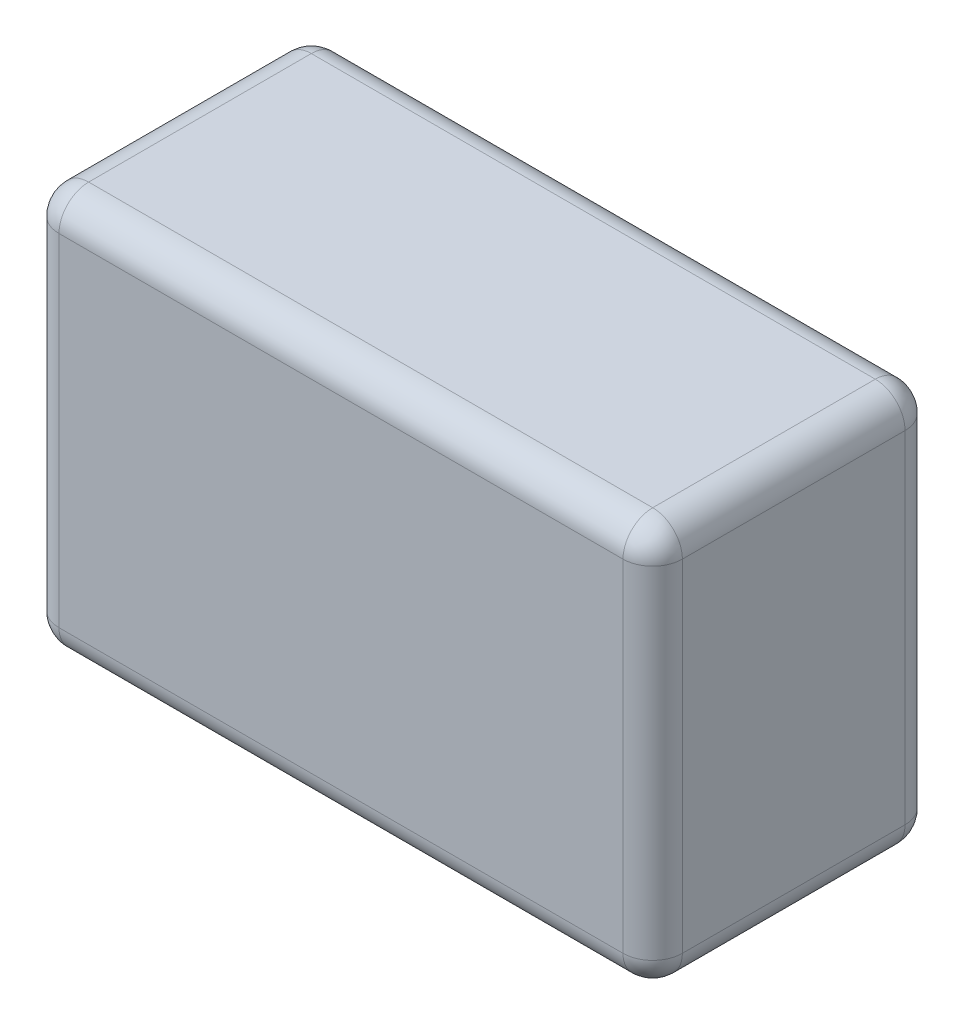
ISO-10303-21;
HEADER;
FILE_DESCRIPTION(('STEP AP214'),'2;1');
FILE_NAME('part.step','',(''),(''),'','','');
FILE_SCHEMA(('AUTOMOTIVE_DESIGN { 1 0 10303 214 1 1 1 1 }'));
ENDSEC;
DATA;
#1=APPLICATION_CONTEXT('core data for automotive mechanical design processes');
#2=APPLICATION_PROTOCOL_DEFINITION('international standard','automotive_design',2000,#1);
#3=PRODUCT_CONTEXT('',#1,'mechanical');
#4=PRODUCT('Part','Part','',(#3));
#5=PRODUCT_RELATED_PRODUCT_CATEGORY('part','',(#4));
#6=PRODUCT_DEFINITION_FORMATION('','',#4);
#7=PRODUCT_DEFINITION_CONTEXT('part definition',#1,'design');
#8=PRODUCT_DEFINITION('design','',#6,#7);
#9=PRODUCT_DEFINITION_SHAPE('','',#8);
#10=(LENGTH_UNIT() NAMED_UNIT(*) SI_UNIT(.MILLI.,.METRE.));
#11=(NAMED_UNIT(*) PLANE_ANGLE_UNIT() SI_UNIT($,.RADIAN.));
#12=(NAMED_UNIT(*) SI_UNIT($,.STERADIAN.) SOLID_ANGLE_UNIT());
#13=UNCERTAINTY_MEASURE_WITH_UNIT(LENGTH_MEASURE(1.E-05),#10,'distance_accuracy_value','');
#14=(GEOMETRIC_REPRESENTATION_CONTEXT(3) GLOBAL_UNCERTAINTY_ASSIGNED_CONTEXT((#13)) GLOBAL_UNIT_ASSIGNED_CONTEXT((#10,
#11,#12)) REPRESENTATION_CONTEXT('',''));
#15=CARTESIAN_POINT('',(0.,0.,0.));
#16=DIRECTION('',(0.,0.,1.));
#17=DIRECTION('',(1.,0.,0.));
#18=AXIS2_PLACEMENT_3D('',#15,#16,#17);
#19=CARTESIAN_POINT('',(0.95,0.575,0.85));
#20=DIRECTION('',(0.,0.,1.));
#21=DIRECTION('',(1.,0.,0.));
#22=AXIS2_PLACEMENT_3D('',#19,#20,#21);
#23=SPHERICAL_SURFACE('',#22,0.1);
#24=CARTESIAN_POINT('',(0.95,0.575,0.85));
#25=DIRECTION('',(-1.,0.,0.));
#26=DIRECTION('',(0.,0.,1.));
#27=AXIS2_PLACEMENT_3D('',#24,#25,#26);
#28=CIRCLE('',#27,0.1);
#29=CARTESIAN_POINT('',(0.95,0.575,0.95));
#30=VERTEX_POINT('',#29);
#31=CARTESIAN_POINT('',(0.95,0.675,0.85));
#32=VERTEX_POINT('',#31);
#33=EDGE_CURVE('E107',#30,#32,#28,.T.);
#34=ORIENTED_EDGE('',*,*,#33,.F.);
#35=CARTESIAN_POINT('',(0.95,0.575,0.85));
#36=DIRECTION('',(0.,-1.,0.));
#37=DIRECTION('',(0.,0.,-1.));
#38=AXIS2_PLACEMENT_3D('',#35,#36,#37);
#39=CIRCLE('',#38,0.1);
#40=CARTESIAN_POINT('',(1.05,0.575,0.85));
#41=VERTEX_POINT('',#40);
#42=EDGE_CURVE('E161',#41,#30,#39,.T.);
#43=ORIENTED_EDGE('',*,*,#42,.F.);
#44=CARTESIAN_POINT('',(0.95,0.575,0.85));
#45=DIRECTION('',(0.,0.,-1.));
#46=DIRECTION('',(-1.,0.,0.));
#47=AXIS2_PLACEMENT_3D('',#44,#45,#46);
#48=CIRCLE('',#47,0.1);
#49=EDGE_CURVE('E133',#32,#41,#48,.T.);
#50=ORIENTED_EDGE('',*,*,#49,.F.);
#51=EDGE_LOOP('',(#34,#43,#50));
#52=FACE_BOUND('',#51,.T.);
#53=ADVANCED_FACE('F16',(#52),#23,.T.);
#54=CARTESIAN_POINT('',(-0.95,0.575,0.85));
#55=DIRECTION('',(0.,0.,1.));
#56=DIRECTION('',(0.,1.,0.));
#57=AXIS2_PLACEMENT_3D('',#54,#55,#56);
#58=SPHERICAL_SURFACE('',#57,0.1);
#59=CARTESIAN_POINT('',(-0.95,0.575,0.85));
#60=DIRECTION('',(0.,-1.,0.));
#61=DIRECTION('',(0.,0.,-1.));
#62=AXIS2_PLACEMENT_3D('',#59,#60,#61);
#63=CIRCLE('',#62,0.1);
#64=CARTESIAN_POINT('',(-0.95,0.575,0.95));
#65=VERTEX_POINT('',#64);
#66=CARTESIAN_POINT('',(-1.05,0.575,0.85));
#67=VERTEX_POINT('',#66);
#68=EDGE_CURVE('E122',#65,#67,#63,.T.);
#69=ORIENTED_EDGE('',*,*,#68,.F.);
#70=CARTESIAN_POINT('',(-0.95,0.575,0.85));
#71=DIRECTION('',(1.,0.,0.));
#72=DIRECTION('',(0.,0.,-1.));
#73=AXIS2_PLACEMENT_3D('',#70,#71,#72);
#74=CIRCLE('',#73,0.1);
#75=CARTESIAN_POINT('',(-0.95,0.675,0.85));
#76=VERTEX_POINT('',#75);
#77=EDGE_CURVE('E104',#76,#65,#74,.T.);
#78=ORIENTED_EDGE('',*,*,#77,.F.);
#79=CARTESIAN_POINT('',(-0.95,0.575,0.85));
#80=DIRECTION('',(0.,0.,-1.));
#81=DIRECTION('',(-1.,0.,0.));
#82=AXIS2_PLACEMENT_3D('',#79,#80,#81);
#83=CIRCLE('',#82,0.1);
#84=EDGE_CURVE('E120',#67,#76,#83,.T.);
#85=ORIENTED_EDGE('',*,*,#84,.F.);
#86=EDGE_LOOP('',(#69,#78,#85));
#87=FACE_BOUND('',#86,.T.);
#88=ADVANCED_FACE('F119',(#87),#58,.T.);
#89=CARTESIAN_POINT('',(-0.95,0.575,0.85));
#90=DIRECTION('',(0.,0.,-1.));
#91=DIRECTION('',(-1.,0.,0.));
#92=AXIS2_PLACEMENT_3D('',#89,#90,#91);
#93=CYLINDRICAL_SURFACE('',#92,0.1);
#94=ORIENTED_EDGE('',*,*,#84,.T.);
#95=DIRECTION('',(0.,0.,1.));
#96=VECTOR('',#95,1.);
#97=CARTESIAN_POINT('',(-0.95,0.675,0.475000000759869));
#98=LINE('',#97,#96);
#99=CARTESIAN_POINT('',(-0.95,0.675,0.1));
#100=VERTEX_POINT('',#99);
#101=EDGE_CURVE('E128',#100,#76,#98,.T.);
#102=ORIENTED_EDGE('',*,*,#101,.F.);
#103=CARTESIAN_POINT('',(-0.95,0.575,0.1));
#104=DIRECTION('',(0.,0.,-1.));
#105=DIRECTION('',(-1.,0.,0.));
#106=AXIS2_PLACEMENT_3D('',#103,#104,#105);
#107=CIRCLE('',#106,0.1);
#108=CARTESIAN_POINT('',(-1.05,0.575,0.1));
#109=VERTEX_POINT('',#108);
#110=EDGE_CURVE('E138',#109,#100,#107,.T.);
#111=ORIENTED_EDGE('',*,*,#110,.F.);
#112=DIRECTION('',(0.,0.,-1.));
#113=VECTOR('',#112,1.);
#114=CARTESIAN_POINT('',(-1.05,0.575,0.475));
#115=LINE('',#114,#113);
#116=EDGE_CURVE('E131',#67,#109,#115,.T.);
#117=ORIENTED_EDGE('',*,*,#116,.F.);
#118=EDGE_LOOP('',(#94,#102,#111,#117));
#119=FACE_BOUND('',#118,.T.);
#120=ADVANCED_FACE('F127',(#119),#93,.T.);
#121=CARTESIAN_POINT('',(0.95,0.575,0.1));
#122=DIRECTION('',(0.,0.,1.));
#123=DIRECTION('',(1.,0.,0.));
#124=AXIS2_PLACEMENT_3D('',#121,#122,#123);
#125=CYLINDRICAL_SURFACE('',#124,0.1);
#126=ORIENTED_EDGE('',*,*,#49,.T.);
#127=DIRECTION('',(0.,0.,1.));
#128=VECTOR('',#127,1.);
#129=CARTESIAN_POINT('',(1.05,0.575,0.475));
#130=LINE('',#129,#128);
#131=CARTESIAN_POINT('',(1.05,0.575,0.1));
#132=VERTEX_POINT('',#131);
#133=EDGE_CURVE('E151',#132,#41,#130,.T.);
#134=ORIENTED_EDGE('',*,*,#133,.F.);
#135=CARTESIAN_POINT('',(0.95,0.575,0.1));
#136=DIRECTION('',(0.,0.,-1.));
#137=DIRECTION('',(-1.,0.,0.));
#138=AXIS2_PLACEMENT_3D('',#135,#136,#137);
#139=CIRCLE('',#138,0.1);
#140=CARTESIAN_POINT('',(0.95,0.675,0.1));
#141=VERTEX_POINT('',#140);
#142=EDGE_CURVE('E140',#141,#132,#139,.T.);
#143=ORIENTED_EDGE('',*,*,#142,.F.);
#144=DIRECTION('',(0.,0.,-1.));
#145=VECTOR('',#144,1.);
#146=CARTESIAN_POINT('',(0.95,0.675,0.474999999240131));
#147=LINE('',#146,#145);
#148=EDGE_CURVE('E137',#32,#141,#147,.T.);
#149=ORIENTED_EDGE('',*,*,#148,.F.);
#150=EDGE_LOOP('',(#126,#134,#143,#149));
#151=FACE_BOUND('',#150,.T.);
#152=ADVANCED_FACE('F313',(#151),#125,.T.);
#153=CARTESIAN_POINT('',(0.95,-0.575,0.85));
#154=DIRECTION('',(0.,1.,0.));
#155=DIRECTION('',(0.,0.,1.));
#156=AXIS2_PLACEMENT_3D('',#153,#154,#155);
#157=CYLINDRICAL_SURFACE('',#156,0.1);
#158=DIRECTION('',(0.,-1.,0.));
#159=VECTOR('',#158,1.);
#160=CARTESIAN_POINT('',(1.05,0.,0.85));
#161=LINE('',#160,#159);
#162=CARTESIAN_POINT('',(1.05,-0.575,0.85));
#163=VERTEX_POINT('',#162);
#164=EDGE_CURVE('E286',#41,#163,#161,.T.);
#165=ORIENTED_EDGE('',*,*,#164,.F.);
#166=ORIENTED_EDGE('',*,*,#42,.T.);
#167=DIRECTION('',(0.,1.,0.));
#168=VECTOR('',#167,1.);
#169=CARTESIAN_POINT('',(0.95,1.07209434472427E-10,0.95));
#170=LINE('',#169,#168);
#171=CARTESIAN_POINT('',(0.95,-0.575,0.95));
#172=VERTEX_POINT('',#171);
#173=EDGE_CURVE('E274',#172,#30,#170,.T.);
#174=ORIENTED_EDGE('',*,*,#173,.F.);
#175=CARTESIAN_POINT('',(0.95,-0.575,0.85));
#176=DIRECTION('',(0.,-1.,0.));
#177=DIRECTION('',(0.,0.,-1.));
#178=AXIS2_PLACEMENT_3D('',#175,#176,#177);
#179=CIRCLE('',#178,0.1);
#180=EDGE_CURVE('E276',#163,#172,#179,.T.);
#181=ORIENTED_EDGE('',*,*,#180,.F.);
#182=EDGE_LOOP('',(#165,#166,#174,#181));
#183=FACE_BOUND('',#182,.T.);
#184=ADVANCED_FACE('F316',(#183),#157,.T.);
#185=CARTESIAN_POINT('',(-0.95,-0.575,0.85));
#186=DIRECTION('',(0.,1.,0.));
#187=DIRECTION('',(0.,0.,1.));
#188=AXIS2_PLACEMENT_3D('',#185,#186,#187);
#189=CYLINDRICAL_SURFACE('',#188,0.1);
#190=DIRECTION('',(0.,-1.,0.));
#191=VECTOR('',#190,1.);
#192=CARTESIAN_POINT('',(-0.95,-7.09761025993738E-11,0.95));
#193=LINE('',#192,#191);
#194=CARTESIAN_POINT('',(-0.95,-0.575,0.95));
#195=VERTEX_POINT('',#194);
#196=EDGE_CURVE('E267',#65,#195,#193,.T.);
#197=ORIENTED_EDGE('',*,*,#196,.F.);
#198=ORIENTED_EDGE('',*,*,#68,.T.);
#199=DIRECTION('',(0.,1.,0.));
#200=VECTOR('',#199,1.);
#201=CARTESIAN_POINT('',(-1.05,0.,0.85));
#202=LINE('',#201,#200);
#203=CARTESIAN_POINT('',(-1.05,-0.575,0.85));
#204=VERTEX_POINT('',#203);
#205=EDGE_CURVE('E152',#204,#67,#202,.T.);
#206=ORIENTED_EDGE('',*,*,#205,.F.);
#207=CARTESIAN_POINT('',(-0.95,-0.575,0.85));
#208=DIRECTION('',(0.,-1.,0.));
#209=DIRECTION('',(0.,0.,-1.));
#210=AXIS2_PLACEMENT_3D('',#207,#208,#209);
#211=CIRCLE('',#210,0.1);
#212=EDGE_CURVE('E281',#195,#204,#211,.T.);
#213=ORIENTED_EDGE('',*,*,#212,.F.);
#214=EDGE_LOOP('',(#197,#198,#206,#213));
#215=FACE_BOUND('',#214,.T.);
#216=ADVANCED_FACE('F381',(#215),#189,.T.);
#217=CARTESIAN_POINT('',(-0.95,0.575,0.1));
#218=DIRECTION('',(0.,0.,-1.));
#219=DIRECTION('',(1.,0.,0.));
#220=AXIS2_PLACEMENT_3D('',#217,#218,#219);
#221=SPHERICAL_SURFACE('',#220,0.1);
#222=CARTESIAN_POINT('',(-0.95,0.575,0.1));
#223=DIRECTION('',(0.,-1.,0.));
#224=DIRECTION('',(0.,0.,-1.));
#225=AXIS2_PLACEMENT_3D('',#222,#223,#224);
#226=CIRCLE('',#225,0.1);
#227=CARTESIAN_POINT('',(-0.95,0.575,0.));
#228=VERTEX_POINT('',#227);
#229=EDGE_CURVE('E257',#109,#228,#226,.T.);
#230=ORIENTED_EDGE('',*,*,#229,.F.);
#231=ORIENTED_EDGE('',*,*,#110,.T.);
#232=CARTESIAN_POINT('',(-0.95,0.575,0.1));
#233=DIRECTION('',(1.,0.,0.));
#234=DIRECTION('',(0.,0.,-1.));
#235=AXIS2_PLACEMENT_3D('',#232,#233,#234);
#236=CIRCLE('',#235,0.1);
#237=EDGE_CURVE('E114',#228,#100,#236,.T.);
#238=ORIENTED_EDGE('',*,*,#237,.F.);
#239=EDGE_LOOP('',(#230,#231,#238));
#240=FACE_BOUND('',#239,.T.);
#241=ADVANCED_FACE('F416',(#240),#221,.T.);
#242=CARTESIAN_POINT('',(0.95,0.575,0.1));
#243=DIRECTION('',(0.,0.,-1.));
#244=DIRECTION('',(0.,-1.,0.));
#245=AXIS2_PLACEMENT_3D('',#242,#243,#244);
#246=SPHERICAL_SURFACE('',#245,0.1);
#247=CARTESIAN_POINT('',(0.95,0.575,0.1));
#248=DIRECTION('',(-1.,0.,0.));
#249=DIRECTION('',(0.,0.,1.));
#250=AXIS2_PLACEMENT_3D('',#247,#248,#249);
#251=CIRCLE('',#250,0.1);
#252=CARTESIAN_POINT('',(0.95,0.575,0.));
#253=VERTEX_POINT('',#252);
#254=EDGE_CURVE('E113',#141,#253,#251,.T.);
#255=ORIENTED_EDGE('',*,*,#254,.F.);
#256=ORIENTED_EDGE('',*,*,#142,.T.);
#257=CARTESIAN_POINT('',(0.95,0.575,0.1));
#258=DIRECTION('',(0.,-1.,0.));
#259=DIRECTION('',(0.,0.,-1.));
#260=AXIS2_PLACEMENT_3D('',#257,#258,#259);
#261=CIRCLE('',#260,0.1);
#262=EDGE_CURVE('E233',#253,#132,#261,.T.);
#263=ORIENTED_EDGE('',*,*,#262,.F.);
#264=EDGE_LOOP('',(#255,#256,#263));
#265=FACE_BOUND('',#264,.T.);
#266=ADVANCED_FACE('F421',(#265),#246,.T.);
#267=CARTESIAN_POINT('',(-1.05,-0.576,0.099));
#268=DIRECTION('',(-1.,0.,0.));
#269=DIRECTION('',(0.,0.,1.));
#270=AXIS2_PLACEMENT_3D('',#267,#268,#269);
#271=PLANE('',#270);
#272=ORIENTED_EDGE('',*,*,#205,.T.);
#273=ORIENTED_EDGE('',*,*,#116,.T.);
#274=DIRECTION('',(0.,1.,0.));
#275=VECTOR('',#274,1.);
#276=CARTESIAN_POINT('',(-1.05,0.,0.1));
#277=LINE('',#276,#275);
#278=CARTESIAN_POINT('',(-1.05,-0.575,0.1));
#279=VERTEX_POINT('',#278);
#280=EDGE_CURVE('E262',#279,#109,#277,.T.);
#281=ORIENTED_EDGE('',*,*,#280,.F.);
#282=DIRECTION('',(0.,0.,-1.));
#283=VECTOR('',#282,1.);
#284=CARTESIAN_POINT('',(-1.05,-0.575,0.475));
#285=LINE('',#284,#283);
#286=EDGE_CURVE('E232',#204,#279,#285,.T.);
#287=ORIENTED_EDGE('',*,*,#286,.F.);
#288=EDGE_LOOP('',(#272,#273,#281,#287));
#289=FACE_BOUND('',#288,.T.);
#290=ADVANCED_FACE('F419',(#289),#271,.T.);
#291=CARTESIAN_POINT('',(1.05,-0.576,0.851));
#292=DIRECTION('',(1.,0.,0.));
#293=DIRECTION('',(0.,0.,-1.));
#294=AXIS2_PLACEMENT_3D('',#291,#292,#293);
#295=PLANE('',#294);
#296=ORIENTED_EDGE('',*,*,#164,.T.);
#297=DIRECTION('',(0.,0.,1.));
#298=VECTOR('',#297,1.);
#299=CARTESIAN_POINT('',(1.05,-0.575,0.475));
#300=LINE('',#299,#298);
#301=CARTESIAN_POINT('',(1.05,-0.575,0.1));
#302=VERTEX_POINT('',#301);
#303=EDGE_CURVE('E226',#302,#163,#300,.T.);
#304=ORIENTED_EDGE('',*,*,#303,.F.);
#305=DIRECTION('',(0.,-1.,0.));
#306=VECTOR('',#305,1.);
#307=CARTESIAN_POINT('',(1.05,0.,0.1));
#308=LINE('',#307,#306);
#309=EDGE_CURVE('E238',#132,#302,#308,.T.);
#310=ORIENTED_EDGE('',*,*,#309,.F.);
#311=ORIENTED_EDGE('',*,*,#133,.T.);
#312=EDGE_LOOP('',(#296,#304,#310,#311));
#313=FACE_BOUND('',#312,.T.);
#314=ADVANCED_FACE('F308',(#313),#295,.T.);
#315=CARTESIAN_POINT('',(-0.95,-0.575,0.85));
#316=DIRECTION('',(0.,0.,1.));
#317=DIRECTION('',(-1.,0.,0.));
#318=AXIS2_PLACEMENT_3D('',#315,#316,#317);
#319=SPHERICAL_SURFACE('',#318,0.1);
#320=CARTESIAN_POINT('',(-0.95,-0.575,0.85));
#321=DIRECTION('',(0.,0.,-1.));
#322=DIRECTION('',(-1.,0.,0.));
#323=AXIS2_PLACEMENT_3D('',#320,#321,#322);
#324=CIRCLE('',#323,0.1);
#325=CARTESIAN_POINT('',(-0.95,-0.675,0.85));
#326=VERTEX_POINT('',#325);
#327=EDGE_CURVE('E229',#326,#204,#324,.T.);
#328=ORIENTED_EDGE('',*,*,#327,.F.);
#329=CARTESIAN_POINT('',(-0.95,-0.575,0.85));
#330=DIRECTION('',(1.,0.,0.));
#331=DIRECTION('',(0.,0.,-1.));
#332=AXIS2_PLACEMENT_3D('',#329,#330,#331);
#333=CIRCLE('',#332,0.1);
#334=EDGE_CURVE('E211',#195,#326,#333,.T.);
#335=ORIENTED_EDGE('',*,*,#334,.F.);
#336=ORIENTED_EDGE('',*,*,#212,.T.);
#337=EDGE_LOOP('',(#328,#335,#336));
#338=FACE_BOUND('',#337,.T.);
#339=ADVANCED_FACE('F377',(#338),#319,.T.);
#340=CARTESIAN_POINT('',(0.95,-0.575,0.85));
#341=DIRECTION('',(0.,0.,1.));
#342=DIRECTION('',(0.,-1.,0.));
#343=AXIS2_PLACEMENT_3D('',#340,#341,#342);
#344=SPHERICAL_SURFACE('',#343,0.1);
#345=CARTESIAN_POINT('',(0.95,-0.575000000000001,0.85));
#346=DIRECTION('',(-1.,0.,0.));
#347=DIRECTION('',(0.,0.,1.));
#348=AXIS2_PLACEMENT_3D('',#345,#346,#347);
#349=CIRCLE('',#348,0.0999999999999995);
#350=CARTESIAN_POINT('',(0.95,-0.675,0.85));
#351=VERTEX_POINT('',#350);
#352=EDGE_CURVE('E202',#351,#172,#349,.T.);
#353=ORIENTED_EDGE('',*,*,#352,.F.);
#354=CARTESIAN_POINT('',(0.95,-0.575,0.85));
#355=DIRECTION('',(0.,0.,-1.));
#356=DIRECTION('',(-1.,0.,0.));
#357=AXIS2_PLACEMENT_3D('',#354,#355,#356);
#358=CIRCLE('',#357,0.1);
#359=EDGE_CURVE('E216',#163,#351,#358,.T.);
#360=ORIENTED_EDGE('',*,*,#359,.F.);
#361=ORIENTED_EDGE('',*,*,#180,.T.);
#362=EDGE_LOOP('',(#353,#360,#361));
#363=FACE_BOUND('',#362,.T.);
#364=ADVANCED_FACE('F319',(#363),#344,.T.);
#365=CARTESIAN_POINT('',(0.61895293528914,0.575,0.85));
#366=DIRECTION('',(-1.,0.,0.));
#367=DIRECTION('',(0.,0.,1.));
#368=AXIS2_PLACEMENT_3D('',#365,#366,#367);
#369=CYLINDRICAL_SURFACE('',#368,0.1);
#370=DIRECTION('',(-1.,0.,0.));
#371=VECTOR('',#370,1.);
#372=CARTESIAN_POINT('',(1.25028752542139E-09,0.575,0.95));
#373=LINE('',#372,#371);
#374=EDGE_CURVE('E199',#30,#65,#373,.T.);
#375=ORIENTED_EDGE('',*,*,#374,.F.);
#376=ORIENTED_EDGE('',*,*,#33,.T.);
#377=DIRECTION('',(1.,0.,0.));
#378=VECTOR('',#377,1.);
#379=CARTESIAN_POINT('',(-1.67369915669846E-11,0.675,0.85));
#380=LINE('',#379,#378);
#381=EDGE_CURVE('E101',#76,#32,#380,.T.);
#382=ORIENTED_EDGE('',*,*,#381,.F.);
#383=ORIENTED_EDGE('',*,*,#77,.T.);
#384=EDGE_LOOP('',(#375,#376,#382,#383));
#385=FACE_BOUND('',#384,.T.);
#386=ADVANCED_FACE('F103',(#385),#369,.T.);
#387=CARTESIAN_POINT('',(-0.95,-0.575,0.1));
#388=DIRECTION('',(0.,1.,0.));
#389=DIRECTION('',(0.,0.,1.));
#390=AXIS2_PLACEMENT_3D('',#387,#388,#389);
#391=CYLINDRICAL_SURFACE('',#390,0.1);
#392=ORIENTED_EDGE('',*,*,#280,.T.);
#393=ORIENTED_EDGE('',*,*,#229,.T.);
#394=DIRECTION('',(0.,1.,0.));
#395=VECTOR('',#394,1.);
#396=CARTESIAN_POINT('',(-0.95,7.09555027580966E-11,0.));
#397=LINE('',#396,#395);
#398=CARTESIAN_POINT('',(-0.95,-0.575,0.));
#399=VERTEX_POINT('',#398);
#400=EDGE_CURVE('E196',#399,#228,#397,.T.);
#401=ORIENTED_EDGE('',*,*,#400,.F.);
#402=CARTESIAN_POINT('',(-0.95,-0.575,0.1));
#403=DIRECTION('',(0.,-1.,0.));
#404=DIRECTION('',(0.,0.,-1.));
#405=AXIS2_PLACEMENT_3D('',#402,#403,#404);
#406=CIRCLE('',#405,0.1);
#407=EDGE_CURVE('E208',#279,#399,#406,.T.);
#408=ORIENTED_EDGE('',*,*,#407,.F.);
#409=EDGE_LOOP('',(#392,#393,#401,#408));
#410=FACE_BOUND('',#409,.T.);
#411=ADVANCED_FACE('F417',(#410),#391,.T.);
#412=CARTESIAN_POINT('',(-0.613226081666086,0.675,0.851000099874663));
#413=DIRECTION('',(0.,1.,0.));
#414=DIRECTION('',(1.,0.,0.));
#415=AXIS2_PLACEMENT_3D('',#412,#413,#414);
#416=PLANE('',#415);
#417=ORIENTED_EDGE('',*,*,#101,.T.);
#418=ORIENTED_EDGE('',*,*,#381,.T.);
#419=ORIENTED_EDGE('',*,*,#148,.T.);
#420=DIRECTION('',(1.,0.,0.));
#421=VECTOR('',#420,1.);
#422=CARTESIAN_POINT('',(9.5624964489751E-08,0.675,0.1));
#423=LINE('',#422,#421);
#424=EDGE_CURVE('E136',#100,#141,#423,.T.);
#425=ORIENTED_EDGE('',*,*,#424,.F.);
#426=EDGE_LOOP('',(#417,#418,#419,#425));
#427=FACE_BOUND('',#426,.T.);
#428=ADVANCED_FACE('F135',(#427),#416,.T.);
#429=CARTESIAN_POINT('',(0.95,-0.575,0.1));
#430=DIRECTION('',(0.,1.,0.));
#431=DIRECTION('',(0.,0.,1.));
#432=AXIS2_PLACEMENT_3D('',#429,#430,#431);
#433=CYLINDRICAL_SURFACE('',#432,0.1);
#434=DIRECTION('',(0.,-1.,0.));
#435=VECTOR('',#434,1.);
#436=CARTESIAN_POINT('',(0.95,-7.03774603698359E-11,0.));
#437=LINE('',#436,#435);
#438=CARTESIAN_POINT('',(0.95,-0.575,0.));
#439=VERTEX_POINT('',#438);
#440=EDGE_CURVE('E195',#253,#439,#437,.T.);
#441=ORIENTED_EDGE('',*,*,#440,.F.);
#442=ORIENTED_EDGE('',*,*,#262,.T.);
#443=ORIENTED_EDGE('',*,*,#309,.T.);
#444=CARTESIAN_POINT('',(0.95,-0.575,0.1));
#445=DIRECTION('',(0.,-1.,0.));
#446=DIRECTION('',(0.,0.,-1.));
#447=AXIS2_PLACEMENT_3D('',#444,#445,#446);
#448=CIRCLE('',#447,0.1);
#449=EDGE_CURVE('E329',#439,#302,#448,.T.);
#450=ORIENTED_EDGE('',*,*,#449,.F.);
#451=EDGE_LOOP('',(#441,#442,#443,#450));
#452=FACE_BOUND('',#451,.T.);
#453=ADVANCED_FACE('F334',(#452),#433,.T.);
#454=CARTESIAN_POINT('',(-0.95,-0.575,0.1));
#455=DIRECTION('',(0.,0.,1.));
#456=DIRECTION('',(1.,0.,0.));
#457=AXIS2_PLACEMENT_3D('',#454,#455,#456);
#458=CYLINDRICAL_SURFACE('',#457,0.1);
#459=ORIENTED_EDGE('',*,*,#327,.T.);
#460=ORIENTED_EDGE('',*,*,#286,.T.);
#461=CARTESIAN_POINT('',(-0.950000000000073,-0.57500000000007,0.1));
#462=DIRECTION('',(0.,0.,-1.));
#463=DIRECTION('',(-1.,0.,0.));
#464=AXIS2_PLACEMENT_3D('',#461,#462,#463);
#465=CIRCLE('',#464,0.0999999999999286);
#466=CARTESIAN_POINT('',(-0.95,-0.675,0.1));
#467=VERTEX_POINT('',#466);
#468=EDGE_CURVE('E201',#467,#279,#465,.T.);
#469=ORIENTED_EDGE('',*,*,#468,.F.);
#470=DIRECTION('',(0.,0.,-1.));
#471=VECTOR('',#470,1.);
#472=CARTESIAN_POINT('',(-0.95,-0.675,0.474999999242992));
#473=LINE('',#472,#471);
#474=EDGE_CURVE('E338',#326,#467,#473,.T.);
#475=ORIENTED_EDGE('',*,*,#474,.F.);
#476=EDGE_LOOP('',(#459,#460,#469,#475));
#477=FACE_BOUND('',#476,.T.);
#478=ADVANCED_FACE('F371',(#477),#458,.T.);
#479=CARTESIAN_POINT('',(0.95,-0.575,0.85));
#480=DIRECTION('',(0.,0.,-1.));
#481=DIRECTION('',(-1.,0.,0.));
#482=AXIS2_PLACEMENT_3D('',#479,#480,#481);
#483=CYLINDRICAL_SURFACE('',#482,0.1);
#484=ORIENTED_EDGE('',*,*,#359,.T.);
#485=DIRECTION('',(0.,0.,1.));
#486=VECTOR('',#485,1.);
#487=CARTESIAN_POINT('',(0.95,-0.675,0.474999999271759));
#488=LINE('',#487,#486);
#489=CARTESIAN_POINT('',(0.95,-0.675,0.1));
#490=VERTEX_POINT('',#489);
#491=EDGE_CURVE('E191',#490,#351,#488,.T.);
#492=ORIENTED_EDGE('',*,*,#491,.F.);
#493=CARTESIAN_POINT('',(0.95,-0.575,0.1));
#494=DIRECTION('',(0.,0.,-1.));
#495=DIRECTION('',(-1.,0.,0.));
#496=AXIS2_PLACEMENT_3D('',#493,#494,#495);
#497=CIRCLE('',#496,0.1);
#498=EDGE_CURVE('E324',#302,#490,#497,.T.);
#499=ORIENTED_EDGE('',*,*,#498,.F.);
#500=ORIENTED_EDGE('',*,*,#303,.T.);
#501=EDGE_LOOP('',(#484,#492,#499,#500));
#502=FACE_BOUND('',#501,.T.);
#503=ADVANCED_FACE('F322',(#502),#483,.T.);
#504=CARTESIAN_POINT('',(-0.614766781174764,-0.576000081533452,0.95));
#505=DIRECTION('',(0.,0.,1.));
#506=DIRECTION('',(1.,0.,0.));
#507=AXIS2_PLACEMENT_3D('',#504,#505,#506);
#508=PLANE('',#507);
#509=ORIENTED_EDGE('',*,*,#374,.T.);
#510=ORIENTED_EDGE('',*,*,#196,.T.);
#511=DIRECTION('',(-1.,0.,0.));
#512=VECTOR('',#511,1.);
#513=CARTESIAN_POINT('',(-4.22967504120145E-09,-0.575,0.95));
#514=LINE('',#513,#512);
#515=EDGE_CURVE('E189',#172,#195,#514,.T.);
#516=ORIENTED_EDGE('',*,*,#515,.F.);
#517=ORIENTED_EDGE('',*,*,#173,.T.);
#518=EDGE_LOOP('',(#509,#510,#516,#517));
#519=FACE_BOUND('',#518,.T.);
#520=ADVANCED_FACE('F382',(#519),#508,.T.);
#521=CARTESIAN_POINT('',(-0.95,-0.575,0.1));
#522=DIRECTION('',(0.,0.,-1.));
#523=DIRECTION('',(0.,1.,0.));
#524=AXIS2_PLACEMENT_3D('',#521,#522,#523);
#525=SPHERICAL_SURFACE('',#524,0.1);
#526=ORIENTED_EDGE('',*,*,#468,.T.);
#527=ORIENTED_EDGE('',*,*,#407,.T.);
#528=CARTESIAN_POINT('',(-0.95,-0.575,0.1));
#529=DIRECTION('',(1.,0.,0.));
#530=DIRECTION('',(0.,0.,-1.));
#531=AXIS2_PLACEMENT_3D('',#528,#529,#530);
#532=CIRCLE('',#531,0.1);
#533=EDGE_CURVE('E186',#467,#399,#532,.T.);
#534=ORIENTED_EDGE('',*,*,#533,.F.);
#535=EDGE_LOOP('',(#526,#527,#534));
#536=FACE_BOUND('',#535,.T.);
#537=ADVANCED_FACE('F364',(#536),#525,.T.);
#538=CARTESIAN_POINT('',(-0.618949867122069,0.575,0.1));
#539=DIRECTION('',(1.,0.,0.));
#540=DIRECTION('',(0.,0.,-1.));
#541=AXIS2_PLACEMENT_3D('',#538,#539,#540);
#542=CYLINDRICAL_SURFACE('',#541,0.1);
#543=DIRECTION('',(1.,0.,0.));
#544=VECTOR('',#543,1.);
#545=CARTESIAN_POINT('',(-1.37040156783161E-09,0.575,0.));
#546=LINE('',#545,#544);
#547=EDGE_CURVE('E184',#228,#253,#546,.T.);
#548=ORIENTED_EDGE('',*,*,#547,.F.);
#549=ORIENTED_EDGE('',*,*,#237,.T.);
#550=ORIENTED_EDGE('',*,*,#424,.T.);
#551=ORIENTED_EDGE('',*,*,#254,.T.);
#552=EDGE_LOOP('',(#548,#549,#550,#551));
#553=FACE_BOUND('',#552,.T.);
#554=ADVANCED_FACE('F390',(#553),#542,.T.);
#555=CARTESIAN_POINT('',(0.95,-0.575,0.1));
#556=DIRECTION('',(0.,0.,-1.));
#557=DIRECTION('',(-1.,0.,0.));
#558=AXIS2_PLACEMENT_3D('',#555,#556,#557);
#559=SPHERICAL_SURFACE('',#558,0.1);
#560=CARTESIAN_POINT('',(0.95,-0.575,0.1));
#561=DIRECTION('',(-1.,0.,0.));
#562=DIRECTION('',(0.,0.,1.));
#563=AXIS2_PLACEMENT_3D('',#560,#561,#562);
#564=CIRCLE('',#563,0.1);
#565=EDGE_CURVE('E181',#439,#490,#564,.T.);
#566=ORIENTED_EDGE('',*,*,#565,.F.);
#567=ORIENTED_EDGE('',*,*,#449,.T.);
#568=ORIENTED_EDGE('',*,*,#498,.T.);
#569=EDGE_LOOP('',(#566,#567,#568));
#570=FACE_BOUND('',#569,.T.);
#571=ADVANCED_FACE('F337',(#570),#559,.T.);
#572=CARTESIAN_POINT('',(-0.618949866460983,-0.575,0.85));
#573=DIRECTION('',(1.,0.,0.));
#574=DIRECTION('',(0.,0.,-1.));
#575=AXIS2_PLACEMENT_3D('',#572,#573,#574);
#576=CYLINDRICAL_SURFACE('',#575,0.1);
#577=DIRECTION('',(-1.,0.,0.));
#578=VECTOR('',#577,1.);
#579=CARTESIAN_POINT('',(-4.51361685657389E-09,-0.675,0.85));
#580=LINE('',#579,#578);
#581=EDGE_CURVE('E177',#351,#326,#580,.T.);
#582=ORIENTED_EDGE('',*,*,#581,.F.);
#583=ORIENTED_EDGE('',*,*,#352,.T.);
#584=ORIENTED_EDGE('',*,*,#515,.T.);
#585=ORIENTED_EDGE('',*,*,#334,.T.);
#586=EDGE_LOOP('',(#582,#583,#584,#585));
#587=FACE_BOUND('',#586,.T.);
#588=ADVANCED_FACE('F379',(#587),#576,.T.);
#589=CARTESIAN_POINT('',(0.614766781070068,-0.576000081605948,0.));
#590=DIRECTION('',(0.,0.,-1.));
#591=DIRECTION('',(-1.,0.,0.));
#592=AXIS2_PLACEMENT_3D('',#589,#590,#591);
#593=PLANE('',#592);
#594=ORIENTED_EDGE('',*,*,#440,.T.);
#595=DIRECTION('',(1.,0.,0.));
#596=VECTOR('',#595,1.);
#597=CARTESIAN_POINT('',(-3.66717507055414E-09,-0.575,0.));
#598=LINE('',#597,#596);
#599=EDGE_CURVE('E26',#399,#439,#598,.T.);
#600=ORIENTED_EDGE('',*,*,#599,.F.);
#601=ORIENTED_EDGE('',*,*,#400,.T.);
#602=ORIENTED_EDGE('',*,*,#547,.T.);
#603=EDGE_LOOP('',(#594,#600,#601,#602));
#604=FACE_BOUND('',#603,.T.);
#605=ADVANCED_FACE('F397',(#604),#593,.T.);
#606=CARTESIAN_POINT('',(0.613226072263197,-0.675,0.851000098357774));
#607=DIRECTION('',(0.,-1.,0.));
#608=DIRECTION('',(-1.,0.,0.));
#609=AXIS2_PLACEMENT_3D('',#606,#607,#608);
#610=PLANE('',#609);
#611=DIRECTION('',(-1.,0.,0.));
#612=VECTOR('',#611,1.);
#613=CARTESIAN_POINT('',(-3.66717507055414E-09,-0.675,0.1));
#614=LINE('',#613,#612);
#615=EDGE_CURVE('E11',#490,#467,#614,.T.);
#616=ORIENTED_EDGE('',*,*,#615,.F.);
#617=ORIENTED_EDGE('',*,*,#491,.T.);
#618=ORIENTED_EDGE('',*,*,#581,.T.);
#619=ORIENTED_EDGE('',*,*,#474,.T.);
#620=EDGE_LOOP('',(#616,#617,#618,#619));
#621=FACE_BOUND('',#620,.T.);
#622=ADVANCED_FACE('F373',(#621),#610,.T.);
#623=CARTESIAN_POINT('',(0.61895005177464,-0.575,0.1));
#624=DIRECTION('',(-1.,0.,0.));
#625=DIRECTION('',(0.,0.,1.));
#626=AXIS2_PLACEMENT_3D('',#623,#624,#625);
#627=CYLINDRICAL_SURFACE('',#626,0.1);
#628=ORIENTED_EDGE('',*,*,#599,.T.);
#629=ORIENTED_EDGE('',*,*,#565,.T.);
#630=ORIENTED_EDGE('',*,*,#615,.T.);
#631=ORIENTED_EDGE('',*,*,#533,.T.);
#632=EDGE_LOOP('',(#628,#629,#630,#631));
#633=FACE_BOUND('',#632,.T.);
#634=ADVANCED_FACE('F18',(#633),#627,.T.);
#635=CLOSED_SHELL('',(#53,#88,#120,#152,#184,#216,#241,#266,#290,#314,#339,#364,#386,#411,#428,
#453,#478,#503,#520,#537,#554,#571,#588,#605,#622,#634));
#636=MANIFOLD_SOLID_BREP('B1',#635);
#637=ADVANCED_BREP_SHAPE_REPRESENTATION('',(#18,#636),#14);
#638=SHAPE_DEFINITION_REPRESENTATION(#9,#637);
ENDSEC;
END-ISO-10303-21;
